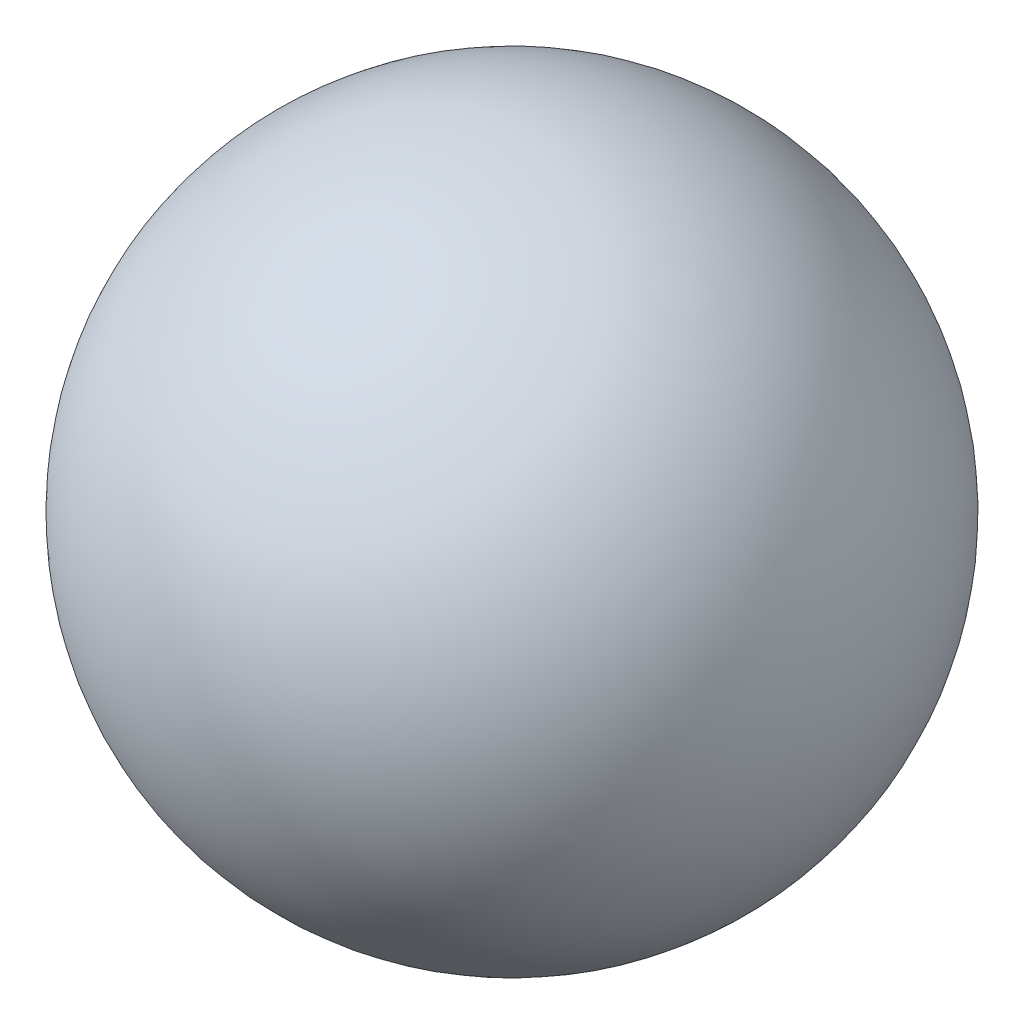
ISO-10303-21;
HEADER;
FILE_DESCRIPTION(('STEP AP214'),'2;1');
FILE_NAME('part.step','',(''),(''),'','','');
FILE_SCHEMA(('AUTOMOTIVE_DESIGN { 1 0 10303 214 1 1 1 1 }'));
ENDSEC;
DATA;
#1=APPLICATION_CONTEXT('core data for automotive mechanical design processes');
#2=APPLICATION_PROTOCOL_DEFINITION('international standard','automotive_design',2000,#1);
#3=PRODUCT_CONTEXT('',#1,'mechanical');
#4=PRODUCT('Part','Part','',(#3));
#5=PRODUCT_RELATED_PRODUCT_CATEGORY('part','',(#4));
#6=PRODUCT_DEFINITION_FORMATION('','',#4);
#7=PRODUCT_DEFINITION_CONTEXT('part definition',#1,'design');
#8=PRODUCT_DEFINITION('design','',#6,#7);
#9=PRODUCT_DEFINITION_SHAPE('','',#8);
#10=(LENGTH_UNIT() NAMED_UNIT(*) SI_UNIT(.MILLI.,.METRE.));
#11=(NAMED_UNIT(*) PLANE_ANGLE_UNIT() SI_UNIT($,.RADIAN.));
#12=(NAMED_UNIT(*) SI_UNIT($,.STERADIAN.) SOLID_ANGLE_UNIT());
#13=UNCERTAINTY_MEASURE_WITH_UNIT(LENGTH_MEASURE(1.E-05),#10,'distance_accuracy_value','');
#14=(GEOMETRIC_REPRESENTATION_CONTEXT(3) GLOBAL_UNCERTAINTY_ASSIGNED_CONTEXT((#13)) GLOBAL_UNIT_ASSIGNED_CONTEXT((#10,
#11,#12)) REPRESENTATION_CONTEXT('',''));
#15=CARTESIAN_POINT('',(0.,0.,0.));
#16=DIRECTION('',(0.,0.,1.));
#17=DIRECTION('',(1.,0.,0.));
#18=AXIS2_PLACEMENT_3D('',#15,#16,#17);
#19=CARTESIAN_POINT('',(64.16,-61.3232373551758,-32.4570677862429));
#20=DIRECTION('',(0.,-0.88383663657057,-0.467795681741101));
#21=DIRECTION('',(0.173648177666933,0.460688814204268,-0.870409172090931));
#22=AXIS2_PLACEMENT_3D('',#19,#20,#21);
#23=SPHERICAL_SURFACE('',#22,7.15);
#24=CARTESIAN_POINT('',(64.16,-55.0038054036962,-29.112328661794));
#25=VERTEX_POINT('',#24);
#26=VERTEX_LOOP('',#25);
#27=FACE_BOUND('',#26,.T.);
#28=CARTESIAN_POINT('',(64.16,-67.6426693066554,-35.8018069106918));
#29=VERTEX_POINT('',#28);
#30=VERTEX_LOOP('',#29);
#31=FACE_BOUND('',#30,.T.);
#32=ADVANCED_FACE('F15',(#27,#31),#23,.T.);
#33=CLOSED_SHELL('',(#32));
#34=MANIFOLD_SOLID_BREP('B1',#33);
#35=ADVANCED_BREP_SHAPE_REPRESENTATION('',(#18,#34),#14);
#36=SHAPE_DEFINITION_REPRESENTATION(#9,#35);
ENDSEC;
END-ISO-10303-21;
